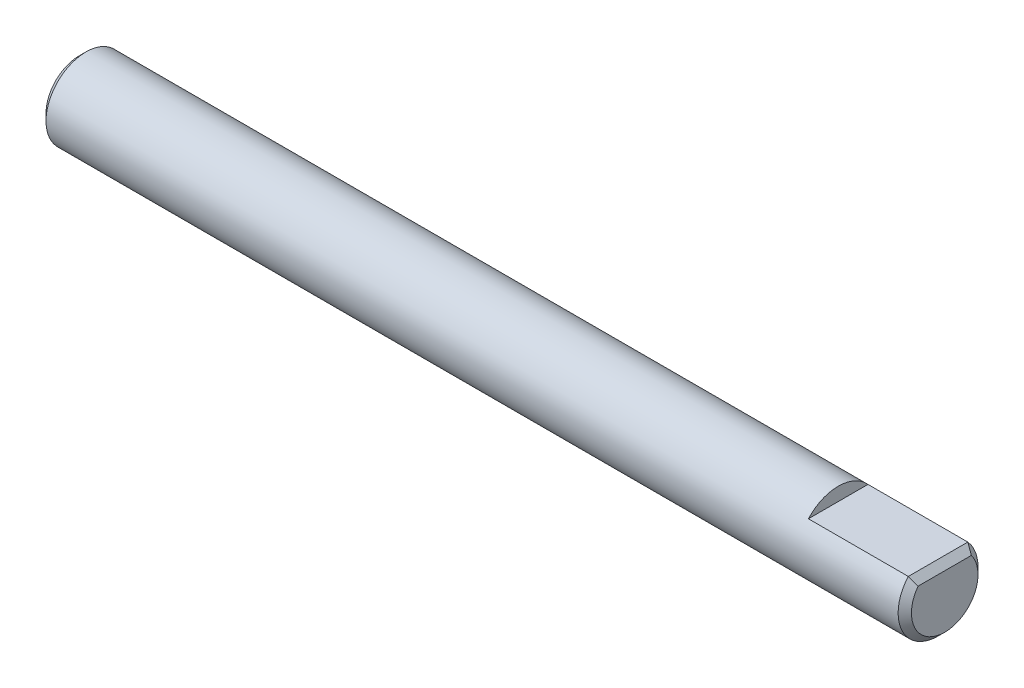
ISO-10303-21;
HEADER;
FILE_DESCRIPTION(('STEP AP214'),'2;1');
FILE_NAME('part.step','',(''),(''),'','','');
FILE_SCHEMA(('AUTOMOTIVE_DESIGN { 1 0 10303 214 1 1 1 1 }'));
ENDSEC;
DATA;
#1=APPLICATION_CONTEXT('core data for automotive mechanical design processes');
#2=APPLICATION_PROTOCOL_DEFINITION('international standard','automotive_design',2000,#1);
#3=PRODUCT_CONTEXT('',#1,'mechanical');
#4=PRODUCT('Part','Part','',(#3));
#5=PRODUCT_RELATED_PRODUCT_CATEGORY('part','',(#4));
#6=PRODUCT_DEFINITION_FORMATION('','',#4);
#7=PRODUCT_DEFINITION_CONTEXT('part definition',#1,'design');
#8=PRODUCT_DEFINITION('design','',#6,#7);
#9=PRODUCT_DEFINITION_SHAPE('','',#8);
#10=(LENGTH_UNIT() NAMED_UNIT(*) SI_UNIT(.MILLI.,.METRE.));
#11=(NAMED_UNIT(*) PLANE_ANGLE_UNIT() SI_UNIT($,.RADIAN.));
#12=(NAMED_UNIT(*) SI_UNIT($,.STERADIAN.) SOLID_ANGLE_UNIT());
#13=UNCERTAINTY_MEASURE_WITH_UNIT(LENGTH_MEASURE(1.E-05),#10,'distance_accuracy_value','');
#14=(GEOMETRIC_REPRESENTATION_CONTEXT(3) GLOBAL_UNCERTAINTY_ASSIGNED_CONTEXT((#13)) GLOBAL_UNIT_ASSIGNED_CONTEXT((#10,
#11,#12)) REPRESENTATION_CONTEXT('',''));
#15=CARTESIAN_POINT('',(0.,0.,0.));
#16=DIRECTION('',(0.,0.,1.));
#17=DIRECTION('',(1.,0.,0.));
#18=AXIS2_PLACEMENT_3D('',#15,#16,#17);
#19=CARTESIAN_POINT('',(32.5,0.,0.));
#20=DIRECTION('',(-1.,0.,0.));
#21=DIRECTION('',(0.,0.,1.));
#22=AXIS2_PLACEMENT_3D('',#19,#20,#21);
#23=CYLINDRICAL_SURFACE('',#22,3.);
#24=CARTESIAN_POINT('',(-32.,0.,0.));
#25=DIRECTION('',(1.,0.,0.));
#26=DIRECTION('',(0.,0.,-1.));
#27=AXIS2_PLACEMENT_3D('',#24,#25,#26);
#28=CIRCLE('',#27,3.);
#29=CARTESIAN_POINT('',(-32.,0.,-3.));
#30=VERTEX_POINT('',#29);
#31=EDGE_CURVE('E108',#30,#30,#28,.T.);
#32=ORIENTED_EDGE('',*,*,#31,.T.);
#33=EDGE_LOOP('',(#32));
#34=FACE_BOUND('',#33,.T.);
#35=DIRECTION('',(1.,0.,0.));
#36=VECTOR('',#35,1.);
#37=CARTESIAN_POINT('',(24.5,2.,-2.23606797749979));
#38=LINE('',#37,#36);
#39=CARTESIAN_POINT('',(24.5,2.,-2.23606797749979));
#40=VERTEX_POINT('',#39);
#41=CARTESIAN_POINT('',(32.,2.,-2.23606797749979));
#42=VERTEX_POINT('',#41);
#43=EDGE_CURVE('E96',#40,#42,#38,.T.);
#44=ORIENTED_EDGE('',*,*,#43,.T.);
#45=CARTESIAN_POINT('',(32.,0.,0.));
#46=DIRECTION('',(1.,0.,0.));
#47=DIRECTION('',(0.,0.,-1.));
#48=AXIS2_PLACEMENT_3D('',#45,#46,#47);
#49=CIRCLE('',#48,3.);
#50=CARTESIAN_POINT('',(32.,2.,2.23606797749979));
#51=VERTEX_POINT('',#50);
#52=EDGE_CURVE('E100',#42,#51,#49,.F.);
#53=ORIENTED_EDGE('',*,*,#52,.T.);
#54=DIRECTION('',(1.,0.,0.));
#55=VECTOR('',#54,1.);
#56=CARTESIAN_POINT('',(24.5,2.,2.23606797749979));
#57=LINE('',#56,#55);
#58=CARTESIAN_POINT('',(24.5,2.,2.23606797749979));
#59=VERTEX_POINT('',#58);
#60=EDGE_CURVE('E95',#59,#51,#57,.T.);
#61=ORIENTED_EDGE('',*,*,#60,.F.);
#62=CARTESIAN_POINT('',(24.5,0.,0.));
#63=DIRECTION('',(1.,0.,0.));
#64=DIRECTION('',(0.,0.,-1.));
#65=AXIS2_PLACEMENT_3D('',#62,#63,#64);
#66=CIRCLE('',#65,3.);
#67=EDGE_CURVE('E83',#40,#59,#66,.T.);
#68=ORIENTED_EDGE('',*,*,#67,.F.);
#69=EDGE_LOOP('',(#44,#53,#61,#68));
#70=FACE_BOUND('',#69,.T.);
#71=ADVANCED_FACE('F39',(#34,#70),#23,.T.);
#72=CARTESIAN_POINT('',(32.5,0.,0.));
#73=DIRECTION('',(1.,0.,0.));
#74=DIRECTION('',(0.,0.,-1.));
#75=AXIS2_PLACEMENT_3D('',#72,#73,#74);
#76=PLANE('',#75);
#77=DIRECTION('',(0.,0.,1.));
#78=VECTOR('',#77,1.);
#79=CARTESIAN_POINT('',(32.5,1.5,2.23606797749979));
#80=LINE('',#79,#78);
#81=CARTESIAN_POINT('',(32.5,1.5,-2.));
#82=VERTEX_POINT('',#81);
#83=CARTESIAN_POINT('',(32.5,1.5,2.));
#84=VERTEX_POINT('',#83);
#85=EDGE_CURVE('E61',#82,#84,#80,.T.);
#86=ORIENTED_EDGE('',*,*,#85,.T.);
#87=CARTESIAN_POINT('',(32.5,0.,0.));
#88=DIRECTION('',(1.,0.,0.));
#89=DIRECTION('',(0.,0.,-1.));
#90=AXIS2_PLACEMENT_3D('',#87,#88,#89);
#91=CIRCLE('',#90,2.5);
#92=EDGE_CURVE('E54',#84,#82,#91,.T.);
#93=ORIENTED_EDGE('',*,*,#92,.T.);
#94=EDGE_LOOP('',(#86,#93));
#95=FACE_BOUND('',#94,.T.);
#96=ADVANCED_FACE('F136',(#95),#76,.T.);
#97=CARTESIAN_POINT('',(-32.5,0.,0.));
#98=DIRECTION('',(1.,0.,0.));
#99=DIRECTION('',(0.,0.,-1.));
#100=AXIS2_PLACEMENT_3D('',#97,#98,#99);
#101=PLANE('',#100);
#102=CARTESIAN_POINT('',(-32.5,0.,0.));
#103=DIRECTION('',(1.,0.,0.));
#104=DIRECTION('',(0.,0.,-1.));
#105=AXIS2_PLACEMENT_3D('',#102,#103,#104);
#106=CIRCLE('',#105,2.50000000000002);
#107=CARTESIAN_POINT('',(-32.5,0.,-2.50000000000002));
#108=VERTEX_POINT('',#107);
#109=EDGE_CURVE('E112',#108,#108,#106,.F.);
#110=ORIENTED_EDGE('',*,*,#109,.T.);
#111=EDGE_LOOP('',(#110));
#112=FACE_BOUND('',#111,.T.);
#113=ADVANCED_FACE('F138',(#112),#101,.F.);
#114=CARTESIAN_POINT('',(24.5,2.,2.23606797749979));
#115=DIRECTION('',(0.,-1.,0.));
#116=DIRECTION('',(0.,0.,-1.));
#117=AXIS2_PLACEMENT_3D('',#114,#115,#116);
#118=PLANE('',#117);
#119=ORIENTED_EDGE('',*,*,#60,.T.);
#120=DIRECTION('',(0.,0.,-1.));
#121=VECTOR('',#120,1.);
#122=CARTESIAN_POINT('',(32.,2.,-2.23606797749979));
#123=LINE('',#122,#121);
#124=EDGE_CURVE('E11',#51,#42,#123,.T.);
#125=ORIENTED_EDGE('',*,*,#124,.T.);
#126=ORIENTED_EDGE('',*,*,#43,.F.);
#127=DIRECTION('',(0.,0.,-1.));
#128=VECTOR('',#127,1.);
#129=CARTESIAN_POINT('',(24.5,2.,2.23606797749979));
#130=LINE('',#129,#128);
#131=EDGE_CURVE('E86',#59,#40,#130,.T.);
#132=ORIENTED_EDGE('',*,*,#131,.F.);
#133=EDGE_LOOP('',(#119,#125,#126,#132));
#134=FACE_BOUND('',#133,.T.);
#135=ADVANCED_FACE('F94',(#134),#118,.F.);
#136=CARTESIAN_POINT('',(24.5,0.,0.));
#137=DIRECTION('',(1.,0.,0.));
#138=DIRECTION('',(0.,0.,-1.));
#139=AXIS2_PLACEMENT_3D('',#136,#137,#138);
#140=PLANE('',#139);
#141=ORIENTED_EDGE('',*,*,#67,.T.);
#142=ORIENTED_EDGE('',*,*,#131,.T.);
#143=EDGE_LOOP('',(#141,#142));
#144=FACE_BOUND('',#143,.T.);
#145=ADVANCED_FACE('F85',(#144),#140,.T.);
#146=CARTESIAN_POINT('',(-32.,0.,0.));
#147=DIRECTION('',(1.,0.,0.));
#148=DIRECTION('',(0.,0.,-1.));
#149=AXIS2_PLACEMENT_3D('',#146,#147,#148);
#150=CONICAL_SURFACE('',#149,3.,0.785398163397446);
#151=ORIENTED_EDGE('',*,*,#109,.F.);
#152=EDGE_LOOP('',(#151));
#153=FACE_BOUND('',#152,.T.);
#154=ORIENTED_EDGE('',*,*,#31,.F.);
#155=EDGE_LOOP('',(#154));
#156=FACE_BOUND('',#155,.T.);
#157=ADVANCED_FACE('F128',(#153,#156),#150,.T.);
#158=CARTESIAN_POINT('',(32.,2.,2.23606797749979));
#159=DIRECTION('',(0.707106781186547,0.707106781186547,0.));
#160=DIRECTION('',(0.,0.,1.));
#161=AXIS2_PLACEMENT_3D('',#158,#159,#160);
#162=PLANE('',#161);
#163=CARTESIAN_POINT('',(32.5,1.5,-2.));
#164=CARTESIAN_POINT('',(32.4585807977048,1.54141920229523,-2.02070857912985));
#165=CARTESIAN_POINT('',(32.4170908559515,1.58290914404846,-2.04113293454125));
#166=CARTESIAN_POINT('',(32.3339853655915,1.6660146344085,-2.08145061491556));
#167=CARTESIAN_POINT('',(32.2923698259851,1.70763017401492,-2.10134397696905));
#168=CARTESIAN_POINT('',(32.2090238468854,1.79097615311456,-2.14063967558382));
#169=CARTESIAN_POINT('',(32.167293409167,1.83270659083301,-2.16004201968289));
#170=CARTESIAN_POINT('',(32.0837244510337,1.91627554896634,-2.19838987344755));
#171=CARTESIAN_POINT('',(32.0418859232564,1.95811407674361,-2.21733535103477));
#172=CARTESIAN_POINT('',(32.,2.,-2.23606797749979));
#173=B_SPLINE_CURVE_WITH_KNOTS('',3,(#163,#164,#165,#166,#167,#168,#169,#170,#171,#172),
.UNSPECIFIED.,.F.,.F.,(4,2,2,2,4),(0.,0.186384056083043,0.372755058743468,0.559123198618541,
0.745504386246809),.UNSPECIFIED.);
#174=EDGE_CURVE('E69',#42,#82,#173,.F.);
#175=ORIENTED_EDGE('',*,*,#174,.F.);
#176=ORIENTED_EDGE('',*,*,#124,.F.);
#177=CARTESIAN_POINT('',(32.,2.,2.23606797749979));
#178=CARTESIAN_POINT('',(32.0418859232564,1.95811407674361,2.21733535103477));
#179=CARTESIAN_POINT('',(32.0837244510337,1.91627554896634,2.19838987344755));
#180=CARTESIAN_POINT('',(32.167293409167,1.83270659083301,2.16004201968289));
#181=CARTESIAN_POINT('',(32.2090238468854,1.79097615311456,2.14063967558382));
#182=CARTESIAN_POINT('',(32.2923698259851,1.70763017401492,2.10134397696905));
#183=CARTESIAN_POINT('',(32.3339853655915,1.6660146344085,2.08145061491556));
#184=CARTESIAN_POINT('',(32.4170908559515,1.58290914404846,2.04113293454125));
#185=CARTESIAN_POINT('',(32.4585807977048,1.54141920229523,2.02070857912985));
#186=CARTESIAN_POINT('',(32.5,1.5,2.));
#187=B_SPLINE_CURVE_WITH_KNOTS('',3,(#177,#178,#179,#180,#181,#182,#183,#184,#185,#186),
.UNSPECIFIED.,.F.,.F.,(4,2,2,2,4),(0.,0.186381187628272,0.372749327503342,0.559120330163767,
0.74550438624681),.UNSPECIFIED.);
#188=EDGE_CURVE('E44',#84,#51,#187,.F.);
#189=ORIENTED_EDGE('',*,*,#188,.F.);
#190=ORIENTED_EDGE('',*,*,#85,.F.);
#191=EDGE_LOOP('',(#175,#176,#189,#190));
#192=FACE_BOUND('',#191,.T.);
#193=ADVANCED_FACE('F124',(#192),#162,.T.);
#194=CARTESIAN_POINT('',(32.5,0.,0.));
#195=DIRECTION('',(-1.,0.,0.));
#196=DIRECTION('',(0.,0.,1.));
#197=AXIS2_PLACEMENT_3D('',#194,#195,#196);
#198=CONICAL_SURFACE('',#197,2.5,0.785398163397448);
#199=ORIENTED_EDGE('',*,*,#188,.T.);
#200=ORIENTED_EDGE('',*,*,#52,.F.);
#201=ORIENTED_EDGE('',*,*,#174,.T.);
#202=ORIENTED_EDGE('',*,*,#92,.F.);
#203=EDGE_LOOP('',(#199,#200,#201,#202));
#204=FACE_BOUND('',#203,.T.);
#205=ADVANCED_FACE('F41',(#204),#198,.T.);
#206=CLOSED_SHELL('',(#71,#96,#113,#135,#145,#157,#193,#205));
#207=MANIFOLD_SOLID_BREP('B2',#206);
#208=ADVANCED_BREP_SHAPE_REPRESENTATION('',(#18,#207),#14);
#209=SHAPE_DEFINITION_REPRESENTATION(#9,#208);
ENDSEC;
END-ISO-10303-21;
